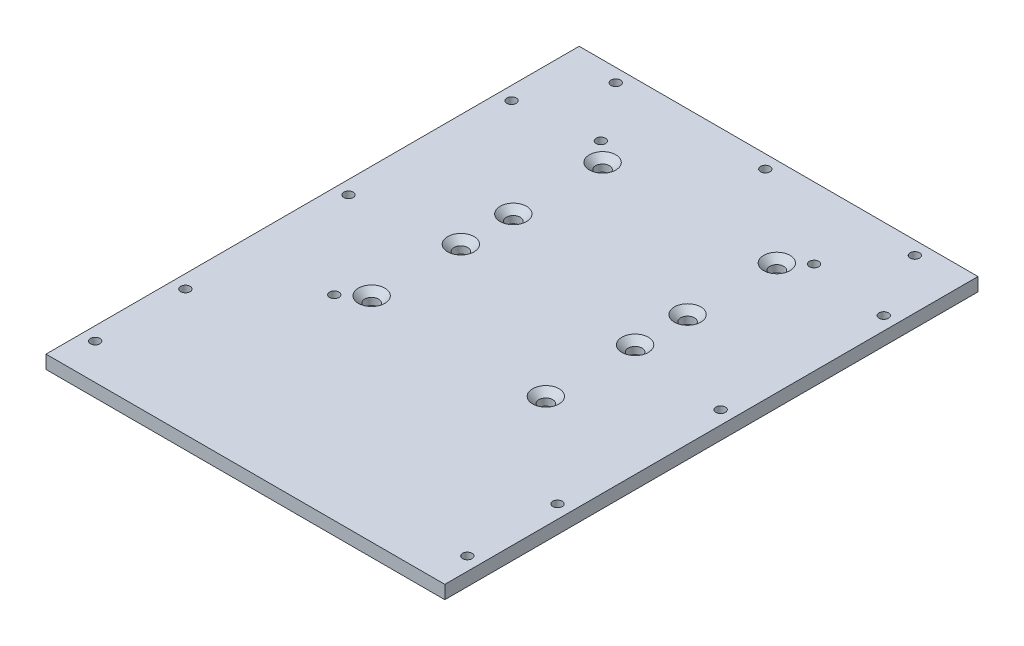
ISO-10303-21;
HEADER;
FILE_DESCRIPTION(('STEP AP214'),'2;1');
FILE_NAME('part.step','',(''),(''),'','','');
FILE_SCHEMA(('AUTOMOTIVE_DESIGN { 1 0 10303 214 1 1 1 1 }'));
ENDSEC;
DATA;
#1=APPLICATION_CONTEXT('core data for automotive mechanical design processes');
#2=APPLICATION_PROTOCOL_DEFINITION('international standard','automotive_design',2000,#1);
#3=PRODUCT_CONTEXT('',#1,'mechanical');
#4=PRODUCT('Part','Part','',(#3));
#5=PRODUCT_RELATED_PRODUCT_CATEGORY('part','',(#4));
#6=PRODUCT_DEFINITION_FORMATION('','',#4);
#7=PRODUCT_DEFINITION_CONTEXT('part definition',#1,'design');
#8=PRODUCT_DEFINITION('design','',#6,#7);
#9=PRODUCT_DEFINITION_SHAPE('','',#8);
#10=(LENGTH_UNIT() NAMED_UNIT(*) SI_UNIT(.MILLI.,.METRE.));
#11=(NAMED_UNIT(*) PLANE_ANGLE_UNIT() SI_UNIT($,.RADIAN.));
#12=(NAMED_UNIT(*) SI_UNIT($,.STERADIAN.) SOLID_ANGLE_UNIT());
#13=UNCERTAINTY_MEASURE_WITH_UNIT(LENGTH_MEASURE(1.E-05),#10,'distance_accuracy_value','');
#14=(GEOMETRIC_REPRESENTATION_CONTEXT(3) GLOBAL_UNCERTAINTY_ASSIGNED_CONTEXT((#13)) GLOBAL_UNIT_ASSIGNED_CONTEXT((#10,
#11,#12)) REPRESENTATION_CONTEXT('',''));
#15=CARTESIAN_POINT('',(0.,0.,0.));
#16=DIRECTION('',(0.,0.,1.));
#17=DIRECTION('',(1.,0.,0.));
#18=AXIS2_PLACEMENT_3D('',#15,#16,#17);
#19=CARTESIAN_POINT('',(0.,6.35,0.));
#20=DIRECTION('',(0.,1.,0.));
#21=DIRECTION('',(0.,0.,1.));
#22=AXIS2_PLACEMENT_3D('',#19,#20,#21);
#23=PLANE('',#22);
#24=CARTESIAN_POINT('',(41.5036,6.35,-17.145));
#25=DIRECTION('',(0.,1.,0.));
#26=DIRECTION('',(0.,0.,1.));
#27=AXIS2_PLACEMENT_3D('',#24,#25,#26);
#28=CIRCLE('',#27,6.2992);
#29=CARTESIAN_POINT('',(41.5036,6.35,-10.8458));
#30=VERTEX_POINT('',#29);
#31=EDGE_CURVE('E632',#30,#30,#28,.T.);
#32=ORIENTED_EDGE('',*,*,#31,.F.);
#33=EDGE_LOOP('',(#32));
#34=FACE_BOUND('',#33,.T.);
#35=CARTESIAN_POINT('',(41.5036,6.35,25.3746));
#36=DIRECTION('',(0.,1.,0.));
#37=DIRECTION('',(0.,0.,1.));
#38=AXIS2_PLACEMENT_3D('',#35,#36,#37);
#39=CIRCLE('',#38,6.2992);
#40=CARTESIAN_POINT('',(41.5036,6.35,31.6738));
#41=VERTEX_POINT('',#40);
#42=EDGE_CURVE('E148',#41,#41,#39,.T.);
#43=ORIENTED_EDGE('',*,*,#42,.F.);
#44=EDGE_LOOP('',(#43));
#45=FACE_BOUND('',#44,.T.);
#46=CARTESIAN_POINT('',(41.5036,6.35,-42.1386));
#47=DIRECTION('',(0.,1.,0.));
#48=DIRECTION('',(0.,0.,1.));
#49=AXIS2_PLACEMENT_3D('',#46,#47,#48);
#50=CIRCLE('',#49,6.2992);
#51=CARTESIAN_POINT('',(41.5036,6.35,-35.8394));
#52=VERTEX_POINT('',#51);
#53=EDGE_CURVE('E141',#52,#52,#50,.T.);
#54=ORIENTED_EDGE('',*,*,#53,.F.);
#55=EDGE_LOOP('',(#54));
#56=FACE_BOUND('',#55,.T.);
#57=CARTESIAN_POINT('',(41.5036,6.35,-84.6582));
#58=DIRECTION('',(0.,1.,0.));
#59=DIRECTION('',(0.,0.,1.));
#60=AXIS2_PLACEMENT_3D('',#57,#58,#59);
#61=CIRCLE('',#60,6.2992);
#62=CARTESIAN_POINT('',(41.5036,6.35,-78.359));
#63=VERTEX_POINT('',#62);
#64=EDGE_CURVE('E137',#63,#63,#61,.T.);
#65=ORIENTED_EDGE('',*,*,#64,.F.);
#66=EDGE_LOOP('',(#65));
#67=FACE_BOUND('',#66,.T.);
#68=CARTESIAN_POINT('',(-41.5036,6.35,-17.145));
#69=DIRECTION('',(0.,1.,0.));
#70=DIRECTION('',(0.,0.,1.));
#71=AXIS2_PLACEMENT_3D('',#68,#69,#70);
#72=CIRCLE('',#71,6.2992);
#73=CARTESIAN_POINT('',(-41.5036,6.35,-10.8458));
#74=VERTEX_POINT('',#73);
#75=EDGE_CURVE('E133',#74,#74,#72,.T.);
#76=ORIENTED_EDGE('',*,*,#75,.F.);
#77=EDGE_LOOP('',(#76));
#78=FACE_BOUND('',#77,.T.);
#79=CARTESIAN_POINT('',(-41.5036,6.35,25.3746));
#80=DIRECTION('',(0.,1.,0.));
#81=DIRECTION('',(0.,0.,1.));
#82=AXIS2_PLACEMENT_3D('',#79,#80,#81);
#83=CIRCLE('',#82,6.2992);
#84=CARTESIAN_POINT('',(-41.5036,6.35,31.6738));
#85=VERTEX_POINT('',#84);
#86=EDGE_CURVE('E128',#85,#85,#83,.T.);
#87=ORIENTED_EDGE('',*,*,#86,.F.);
#88=EDGE_LOOP('',(#87));
#89=FACE_BOUND('',#88,.T.);
#90=CARTESIAN_POINT('',(-41.5036,6.35,-42.1386));
#91=DIRECTION('',(0.,1.,0.));
#92=DIRECTION('',(0.,0.,1.));
#93=AXIS2_PLACEMENT_3D('',#90,#91,#92);
#94=CIRCLE('',#93,6.2992);
#95=CARTESIAN_POINT('',(-41.5036,6.35,-35.8394));
#96=VERTEX_POINT('',#95);
#97=EDGE_CURVE('E123',#96,#96,#94,.T.);
#98=ORIENTED_EDGE('',*,*,#97,.F.);
#99=EDGE_LOOP('',(#98));
#100=FACE_BOUND('',#99,.T.);
#101=CARTESIAN_POINT('',(-41.5036,6.35,-84.6582));
#102=DIRECTION('',(0.,1.,0.));
#103=DIRECTION('',(0.,0.,1.));
#104=AXIS2_PLACEMENT_3D('',#101,#102,#103);
#105=CIRCLE('',#104,6.2992);
#106=CARTESIAN_POINT('',(-41.5036,6.35,-78.359));
#107=VERTEX_POINT('',#106);
#108=EDGE_CURVE('E118',#107,#107,#105,.T.);
#109=ORIENTED_EDGE('',*,*,#108,.F.);
#110=EDGE_LOOP('',(#109));
#111=FACE_BOUND('',#110,.T.);
#112=CARTESIAN_POINT('',(-50.8,6.35,33.8836));
#113=DIRECTION('',(0.,1.,0.));
#114=DIRECTION('',(0.,0.,1.));
#115=AXIS2_PLACEMENT_3D('',#112,#113,#114);
#116=CIRCLE('',#115,2.2479);
#117=CARTESIAN_POINT('',(-50.8,6.35,36.1315));
#118=VERTEX_POINT('',#117);
#119=EDGE_CURVE('E113',#118,#118,#116,.T.);
#120=ORIENTED_EDGE('',*,*,#119,.F.);
#121=EDGE_LOOP('',(#120));
#122=FACE_BOUND('',#121,.T.);
#123=CARTESIAN_POINT('',(88.646,6.35,66.9544));
#124=DIRECTION('',(0.,-1.,0.));
#125=DIRECTION('',(0.,0.,1.));
#126=AXIS2_PLACEMENT_3D('',#123,#124,#125);
#127=CIRCLE('',#126,2.2479);
#128=CARTESIAN_POINT('',(88.646,6.35,69.2023));
#129=VERTEX_POINT('',#128);
#130=EDGE_CURVE('E194',#129,#129,#127,.T.);
#131=ORIENTED_EDGE('',*,*,#130,.T.);
#132=EDGE_LOOP('',(#131));
#133=FACE_BOUND('',#132,.T.);
#134=CARTESIAN_POINT('',(88.646,6.35,-88.4428));
#135=DIRECTION('',(0.,-1.,0.));
#136=DIRECTION('',(0.,0.,1.));
#137=AXIS2_PLACEMENT_3D('',#134,#135,#136);
#138=CIRCLE('',#137,2.2479);
#139=CARTESIAN_POINT('',(88.646,6.35,-86.1949));
#140=VERTEX_POINT('',#139);
#141=EDGE_CURVE('E206',#140,#140,#138,.T.);
#142=ORIENTED_EDGE('',*,*,#141,.T.);
#143=EDGE_LOOP('',(#142));
#144=FACE_BOUND('',#143,.T.);
#145=CARTESIAN_POINT('',(71.247,6.35,-120.65));
#146=DIRECTION('',(0.,-1.,0.));
#147=DIRECTION('',(0.,0.,1.));
#148=AXIS2_PLACEMENT_3D('',#145,#146,#147);
#149=CIRCLE('',#148,2.2479);
#150=CARTESIAN_POINT('',(71.247,6.35,-118.4021));
#151=VERTEX_POINT('',#150);
#152=EDGE_CURVE('E181',#151,#151,#149,.T.);
#153=ORIENTED_EDGE('',*,*,#152,.T.);
#154=EDGE_LOOP('',(#153));
#155=FACE_BOUND('',#154,.T.);
#156=CARTESIAN_POINT('',(-88.646,6.35,109.9312));
#157=DIRECTION('',(0.,1.,0.));
#158=DIRECTION('',(0.,0.,1.));
#159=AXIS2_PLACEMENT_3D('',#156,#157,#158);
#160=CIRCLE('',#159,2.2479);
#161=CARTESIAN_POINT('',(-88.646,6.35,112.1791));
#162=VERTEX_POINT('',#161);
#163=EDGE_CURVE('E222',#162,#162,#160,.T.);
#164=ORIENTED_EDGE('',*,*,#163,.F.);
#165=EDGE_LOOP('',(#164));
#166=FACE_BOUND('',#165,.T.);
#167=CARTESIAN_POINT('',(-88.646,6.35,66.9544));
#168=DIRECTION('',(0.,1.,0.));
#169=DIRECTION('',(0.,0.,1.));
#170=AXIS2_PLACEMENT_3D('',#167,#168,#169);
#171=CIRCLE('',#170,2.2479);
#172=CARTESIAN_POINT('',(-88.646,6.35,69.2023));
#173=VERTEX_POINT('',#172);
#174=EDGE_CURVE('E228',#173,#173,#171,.T.);
#175=ORIENTED_EDGE('',*,*,#174,.F.);
#176=EDGE_LOOP('',(#175));
#177=FACE_BOUND('',#176,.T.);
#178=CARTESIAN_POINT('',(-88.646,6.35,-10.7442));
#179=DIRECTION('',(0.,1.,0.));
#180=DIRECTION('',(0.,0.,1.));
#181=AXIS2_PLACEMENT_3D('',#178,#179,#180);
#182=CIRCLE('',#181,2.2479);
#183=CARTESIAN_POINT('',(-88.646,6.35,-8.49629999999999));
#184=VERTEX_POINT('',#183);
#185=EDGE_CURVE('E234',#184,#184,#182,.T.);
#186=ORIENTED_EDGE('',*,*,#185,.F.);
#187=EDGE_LOOP('',(#186));
#188=FACE_BOUND('',#187,.T.);
#189=CARTESIAN_POINT('',(-88.646,6.35,-88.4428));
#190=DIRECTION('',(0.,1.,0.));
#191=DIRECTION('',(0.,0.,1.));
#192=AXIS2_PLACEMENT_3D('',#189,#190,#191);
#193=CIRCLE('',#192,2.2479);
#194=CARTESIAN_POINT('',(-88.646,6.35,-86.1949));
#195=VERTEX_POINT('',#194);
#196=EDGE_CURVE('E240',#195,#195,#193,.T.);
#197=ORIENTED_EDGE('',*,*,#196,.F.);
#198=EDGE_LOOP('',(#197));
#199=FACE_BOUND('',#198,.T.);
#200=CARTESIAN_POINT('',(-50.8,6.35,-93.1164));
#201=DIRECTION('',(0.,1.,0.));
#202=DIRECTION('',(0.,0.,1.));
#203=AXIS2_PLACEMENT_3D('',#200,#201,#202);
#204=CIRCLE('',#203,2.2479);
#205=CARTESIAN_POINT('',(-50.8,6.35,-90.8685));
#206=VERTEX_POINT('',#205);
#207=EDGE_CURVE('E246',#206,#206,#204,.T.);
#208=ORIENTED_EDGE('',*,*,#207,.F.);
#209=EDGE_LOOP('',(#208));
#210=FACE_BOUND('',#209,.T.);
#211=CARTESIAN_POINT('',(-71.247,6.35,-120.65));
#212=DIRECTION('',(0.,1.,0.));
#213=DIRECTION('',(0.,0.,1.));
#214=AXIS2_PLACEMENT_3D('',#211,#212,#213);
#215=CIRCLE('',#214,2.2479);
#216=CARTESIAN_POINT('',(-71.247,6.35,-118.4021));
#217=VERTEX_POINT('',#216);
#218=EDGE_CURVE('E252',#217,#217,#215,.T.);
#219=ORIENTED_EDGE('',*,*,#218,.F.);
#220=EDGE_LOOP('',(#219));
#221=FACE_BOUND('',#220,.T.);
#222=CARTESIAN_POINT('',(0.,6.35,-120.65));
#223=DIRECTION('',(0.,1.,0.));
#224=DIRECTION('',(0.,0.,1.));
#225=AXIS2_PLACEMENT_3D('',#222,#223,#224);
#226=CIRCLE('',#225,2.2479);
#227=CARTESIAN_POINT('',(0.,6.35,-118.4021));
#228=VERTEX_POINT('',#227);
#229=EDGE_CURVE('E187',#228,#228,#226,.T.);
#230=ORIENTED_EDGE('',*,*,#229,.F.);
#231=EDGE_LOOP('',(#230));
#232=FACE_BOUND('',#231,.T.);
#233=DIRECTION('',(0.,0.,1.));
#234=VECTOR('',#233,1.);
#235=CARTESIAN_POINT('',(-94.996,6.35,-127.));
#236=LINE('',#235,#234);
#237=CARTESIAN_POINT('',(-94.996,6.35,-127.));
#238=VERTEX_POINT('',#237);
#239=CARTESIAN_POINT('',(-94.996,6.35,127.));
#240=VERTEX_POINT('',#239);
#241=EDGE_CURVE('E88',#238,#240,#236,.T.);
#242=ORIENTED_EDGE('',*,*,#241,.T.);
#243=DIRECTION('',(1.,0.,0.));
#244=VECTOR('',#243,1.);
#245=CARTESIAN_POINT('',(-94.996,6.35,127.));
#246=LINE('',#245,#244);
#247=CARTESIAN_POINT('',(94.996,6.35,127.));
#248=VERTEX_POINT('',#247);
#249=EDGE_CURVE('E83',#240,#248,#246,.T.);
#250=ORIENTED_EDGE('',*,*,#249,.T.);
#251=DIRECTION('',(0.,0.,-1.));
#252=VECTOR('',#251,1.);
#253=CARTESIAN_POINT('',(94.996,6.35,-127.));
#254=LINE('',#253,#252);
#255=CARTESIAN_POINT('',(94.996,6.35,-127.));
#256=VERTEX_POINT('',#255);
#257=EDGE_CURVE('E86',#248,#256,#254,.T.);
#258=ORIENTED_EDGE('',*,*,#257,.T.);
#259=DIRECTION('',(-1.,0.,0.));
#260=VECTOR('',#259,1.);
#261=CARTESIAN_POINT('',(-94.996,6.35,-127.));
#262=LINE('',#261,#260);
#263=EDGE_CURVE('E53',#256,#238,#262,.T.);
#264=ORIENTED_EDGE('',*,*,#263,.T.);
#265=EDGE_LOOP('',(#242,#250,#258,#264));
#266=FACE_BOUND('',#265,.T.);
#267=CARTESIAN_POINT('',(50.8,6.35,-93.1164));
#268=DIRECTION('',(0.,-1.,0.));
#269=DIRECTION('',(0.,0.,1.));
#270=AXIS2_PLACEMENT_3D('',#267,#268,#269);
#271=CIRCLE('',#270,2.2479);
#272=CARTESIAN_POINT('',(50.8,6.35,-90.8685));
#273=VERTEX_POINT('',#272);
#274=EDGE_CURVE('E212',#273,#273,#271,.T.);
#275=ORIENTED_EDGE('',*,*,#274,.T.);
#276=EDGE_LOOP('',(#275));
#277=FACE_BOUND('',#276,.T.);
#278=CARTESIAN_POINT('',(88.646,6.35,-10.7442));
#279=DIRECTION('',(0.,-1.,0.));
#280=DIRECTION('',(0.,0.,1.));
#281=AXIS2_PLACEMENT_3D('',#278,#279,#280);
#282=CIRCLE('',#281,2.2479);
#283=CARTESIAN_POINT('',(88.646,6.35,-8.49629999999999));
#284=VERTEX_POINT('',#283);
#285=EDGE_CURVE('E200',#284,#284,#282,.T.);
#286=ORIENTED_EDGE('',*,*,#285,.T.);
#287=EDGE_LOOP('',(#286));
#288=FACE_BOUND('',#287,.T.);
#289=CARTESIAN_POINT('',(88.646,6.35,109.9312));
#290=DIRECTION('',(0.,-1.,0.));
#291=DIRECTION('',(0.,0.,1.));
#292=AXIS2_PLACEMENT_3D('',#289,#290,#291);
#293=CIRCLE('',#292,2.2479);
#294=CARTESIAN_POINT('',(88.646,6.35,112.1791));
#295=VERTEX_POINT('',#294);
#296=EDGE_CURVE('E188',#295,#295,#293,.T.);
#297=ORIENTED_EDGE('',*,*,#296,.T.);
#298=EDGE_LOOP('',(#297));
#299=FACE_BOUND('',#298,.T.);
#300=ADVANCED_FACE('F34',(#34,#45,#56,#67,#78,#89,#100,#111,#122,#133,#144,#155,#166,#177,#188,
#199,#210,#221,#232,#266,#277,#288,#299),#23,.T.);
#301=CARTESIAN_POINT('',(0.,0.,0.));
#302=DIRECTION('',(0.,1.,0.));
#303=DIRECTION('',(0.,0.,1.));
#304=AXIS2_PLACEMENT_3D('',#301,#302,#303);
#305=PLANE('',#304);
#306=CARTESIAN_POINT('',(41.5036,0.,-17.145));
#307=DIRECTION('',(0.,1.,0.));
#308=DIRECTION('',(0.,0.,1.));
#309=AXIS2_PLACEMENT_3D('',#306,#307,#308);
#310=CIRCLE('',#309,3.302);
#311=CARTESIAN_POINT('',(41.5036,0.,-13.843));
#312=VERTEX_POINT('',#311);
#313=EDGE_CURVE('E38',#312,#312,#310,.T.);
#314=ORIENTED_EDGE('',*,*,#313,.T.);
#315=EDGE_LOOP('',(#314));
#316=FACE_BOUND('',#315,.T.);
#317=CARTESIAN_POINT('',(41.5036,0.,25.3746));
#318=DIRECTION('',(0.,1.,0.));
#319=DIRECTION('',(0.,0.,1.));
#320=AXIS2_PLACEMENT_3D('',#317,#318,#319);
#321=CIRCLE('',#320,3.302);
#322=CARTESIAN_POINT('',(41.5036,0.,28.6766));
#323=VERTEX_POINT('',#322);
#324=EDGE_CURVE('E139',#323,#323,#321,.T.);
#325=ORIENTED_EDGE('',*,*,#324,.T.);
#326=EDGE_LOOP('',(#325));
#327=FACE_BOUND('',#326,.T.);
#328=CARTESIAN_POINT('',(41.5036,0.,-42.1386));
#329=DIRECTION('',(0.,1.,0.));
#330=DIRECTION('',(0.,0.,1.));
#331=AXIS2_PLACEMENT_3D('',#328,#329,#330);
#332=CIRCLE('',#331,3.302);
#333=CARTESIAN_POINT('',(41.5036,0.,-38.8366));
#334=VERTEX_POINT('',#333);
#335=EDGE_CURVE('E135',#334,#334,#332,.T.);
#336=ORIENTED_EDGE('',*,*,#335,.T.);
#337=EDGE_LOOP('',(#336));
#338=FACE_BOUND('',#337,.T.);
#339=CARTESIAN_POINT('',(41.5036,0.,-84.6582));
#340=DIRECTION('',(0.,1.,0.));
#341=DIRECTION('',(0.,0.,1.));
#342=AXIS2_PLACEMENT_3D('',#339,#340,#341);
#343=CIRCLE('',#342,3.302);
#344=CARTESIAN_POINT('',(41.5036,0.,-81.3562));
#345=VERTEX_POINT('',#344);
#346=EDGE_CURVE('E130',#345,#345,#343,.T.);
#347=ORIENTED_EDGE('',*,*,#346,.T.);
#348=EDGE_LOOP('',(#347));
#349=FACE_BOUND('',#348,.T.);
#350=CARTESIAN_POINT('',(-41.5036,0.,-17.145));
#351=DIRECTION('',(0.,1.,0.));
#352=DIRECTION('',(0.,0.,1.));
#353=AXIS2_PLACEMENT_3D('',#350,#351,#352);
#354=CIRCLE('',#353,3.302);
#355=CARTESIAN_POINT('',(-41.5036,0.,-13.843));
#356=VERTEX_POINT('',#355);
#357=EDGE_CURVE('E125',#356,#356,#354,.T.);
#358=ORIENTED_EDGE('',*,*,#357,.T.);
#359=EDGE_LOOP('',(#358));
#360=FACE_BOUND('',#359,.T.);
#361=CARTESIAN_POINT('',(-41.5036,0.,25.3746));
#362=DIRECTION('',(0.,1.,0.));
#363=DIRECTION('',(0.,0.,1.));
#364=AXIS2_PLACEMENT_3D('',#361,#362,#363);
#365=CIRCLE('',#364,3.302);
#366=CARTESIAN_POINT('',(-41.5036,0.,28.6766));
#367=VERTEX_POINT('',#366);
#368=EDGE_CURVE('E120',#367,#367,#365,.T.);
#369=ORIENTED_EDGE('',*,*,#368,.T.);
#370=EDGE_LOOP('',(#369));
#371=FACE_BOUND('',#370,.T.);
#372=CARTESIAN_POINT('',(-41.5036,0.,-42.1386));
#373=DIRECTION('',(0.,1.,0.));
#374=DIRECTION('',(0.,0.,1.));
#375=AXIS2_PLACEMENT_3D('',#372,#373,#374);
#376=CIRCLE('',#375,3.302);
#377=CARTESIAN_POINT('',(-41.5036,0.,-38.8366));
#378=VERTEX_POINT('',#377);
#379=EDGE_CURVE('E115',#378,#378,#376,.T.);
#380=ORIENTED_EDGE('',*,*,#379,.T.);
#381=EDGE_LOOP('',(#380));
#382=FACE_BOUND('',#381,.T.);
#383=CARTESIAN_POINT('',(-41.5036,0.,-84.6582));
#384=DIRECTION('',(0.,1.,0.));
#385=DIRECTION('',(0.,0.,1.));
#386=AXIS2_PLACEMENT_3D('',#383,#384,#385);
#387=CIRCLE('',#386,3.302);
#388=CARTESIAN_POINT('',(-41.5036,0.,-81.3562));
#389=VERTEX_POINT('',#388);
#390=EDGE_CURVE('E110',#389,#389,#387,.T.);
#391=ORIENTED_EDGE('',*,*,#390,.T.);
#392=EDGE_LOOP('',(#391));
#393=FACE_BOUND('',#392,.T.);
#394=CARTESIAN_POINT('',(-50.8,0.,33.8836));
#395=DIRECTION('',(0.,1.,0.));
#396=DIRECTION('',(0.,0.,1.));
#397=AXIS2_PLACEMENT_3D('',#394,#395,#396);
#398=CIRCLE('',#397,2.2479);
#399=CARTESIAN_POINT('',(-50.8,0.,36.1315));
#400=VERTEX_POINT('',#399);
#401=EDGE_CURVE('E178',#400,#400,#398,.T.);
#402=ORIENTED_EDGE('',*,*,#401,.T.);
#403=EDGE_LOOP('',(#402));
#404=FACE_BOUND('',#403,.T.);
#405=CARTESIAN_POINT('',(-88.646,0.,109.9312));
#406=DIRECTION('',(0.,1.,0.));
#407=DIRECTION('',(0.,0.,1.));
#408=AXIS2_PLACEMENT_3D('',#405,#406,#407);
#409=CIRCLE('',#408,2.2479);
#410=CARTESIAN_POINT('',(-88.646,0.,112.1791));
#411=VERTEX_POINT('',#410);
#412=EDGE_CURVE('E104',#411,#411,#409,.T.);
#413=ORIENTED_EDGE('',*,*,#412,.T.);
#414=EDGE_LOOP('',(#413));
#415=FACE_BOUND('',#414,.T.);
#416=CARTESIAN_POINT('',(-88.646,0.,66.9544));
#417=DIRECTION('',(0.,1.,0.));
#418=DIRECTION('',(0.,0.,1.));
#419=AXIS2_PLACEMENT_3D('',#416,#417,#418);
#420=CIRCLE('',#419,2.2479);
#421=CARTESIAN_POINT('',(-88.646,0.,69.2023));
#422=VERTEX_POINT('',#421);
#423=EDGE_CURVE('E225',#422,#422,#420,.T.);
#424=ORIENTED_EDGE('',*,*,#423,.T.);
#425=EDGE_LOOP('',(#424));
#426=FACE_BOUND('',#425,.T.);
#427=CARTESIAN_POINT('',(-88.646,0.,-10.7442));
#428=DIRECTION('',(0.,1.,0.));
#429=DIRECTION('',(0.,0.,1.));
#430=AXIS2_PLACEMENT_3D('',#427,#428,#429);
#431=CIRCLE('',#430,2.2479);
#432=CARTESIAN_POINT('',(-88.646,0.,-8.49629999999999));
#433=VERTEX_POINT('',#432);
#434=EDGE_CURVE('E231',#433,#433,#431,.T.);
#435=ORIENTED_EDGE('',*,*,#434,.T.);
#436=EDGE_LOOP('',(#435));
#437=FACE_BOUND('',#436,.T.);
#438=CARTESIAN_POINT('',(-88.646,0.,-88.4428));
#439=DIRECTION('',(0.,1.,0.));
#440=DIRECTION('',(0.,0.,1.));
#441=AXIS2_PLACEMENT_3D('',#438,#439,#440);
#442=CIRCLE('',#441,2.2479);
#443=CARTESIAN_POINT('',(-88.646,0.,-86.1949));
#444=VERTEX_POINT('',#443);
#445=EDGE_CURVE('E237',#444,#444,#442,.T.);
#446=ORIENTED_EDGE('',*,*,#445,.T.);
#447=EDGE_LOOP('',(#446));
#448=FACE_BOUND('',#447,.T.);
#449=CARTESIAN_POINT('',(-50.8,0.,-93.1164));
#450=DIRECTION('',(0.,1.,0.));
#451=DIRECTION('',(0.,0.,1.));
#452=AXIS2_PLACEMENT_3D('',#449,#450,#451);
#453=CIRCLE('',#452,2.2479);
#454=CARTESIAN_POINT('',(-50.8,0.,-90.8685));
#455=VERTEX_POINT('',#454);
#456=EDGE_CURVE('E243',#455,#455,#453,.T.);
#457=ORIENTED_EDGE('',*,*,#456,.T.);
#458=EDGE_LOOP('',(#457));
#459=FACE_BOUND('',#458,.T.);
#460=CARTESIAN_POINT('',(-71.247,0.,-120.65));
#461=DIRECTION('',(0.,1.,0.));
#462=DIRECTION('',(0.,0.,1.));
#463=AXIS2_PLACEMENT_3D('',#460,#461,#462);
#464=CIRCLE('',#463,2.2479);
#465=CARTESIAN_POINT('',(-71.247,0.,-118.4021));
#466=VERTEX_POINT('',#465);
#467=EDGE_CURVE('E249',#466,#466,#464,.T.);
#468=ORIENTED_EDGE('',*,*,#467,.T.);
#469=EDGE_LOOP('',(#468));
#470=FACE_BOUND('',#469,.T.);
#471=CARTESIAN_POINT('',(0.,0.,-120.65));
#472=DIRECTION('',(0.,1.,0.));
#473=DIRECTION('',(0.,0.,1.));
#474=AXIS2_PLACEMENT_3D('',#471,#472,#473);
#475=CIRCLE('',#474,2.2479);
#476=CARTESIAN_POINT('',(0.,0.,-118.4021));
#477=VERTEX_POINT('',#476);
#478=EDGE_CURVE('E255',#477,#477,#475,.T.);
#479=ORIENTED_EDGE('',*,*,#478,.T.);
#480=EDGE_LOOP('',(#479));
#481=FACE_BOUND('',#480,.T.);
#482=DIRECTION('',(0.,0.,1.));
#483=VECTOR('',#482,1.);
#484=CARTESIAN_POINT('',(-94.996,0.,-127.));
#485=LINE('',#484,#483);
#486=CARTESIAN_POINT('',(-94.996,0.,-127.));
#487=VERTEX_POINT('',#486);
#488=CARTESIAN_POINT('',(-94.996,0.,127.));
#489=VERTEX_POINT('',#488);
#490=EDGE_CURVE('E101',#487,#489,#485,.T.);
#491=ORIENTED_EDGE('',*,*,#490,.F.);
#492=DIRECTION('',(-1.,0.,0.));
#493=VECTOR('',#492,1.);
#494=CARTESIAN_POINT('',(-94.996,0.,-127.));
#495=LINE('',#494,#493);
#496=CARTESIAN_POINT('',(94.996,0.,-127.));
#497=VERTEX_POINT('',#496);
#498=EDGE_CURVE('E76',#497,#487,#495,.T.);
#499=ORIENTED_EDGE('',*,*,#498,.F.);
#500=DIRECTION('',(0.,0.,-1.));
#501=VECTOR('',#500,1.);
#502=CARTESIAN_POINT('',(94.996,0.,-127.));
#503=LINE('',#502,#501);
#504=CARTESIAN_POINT('',(94.996,0.,127.));
#505=VERTEX_POINT('',#504);
#506=EDGE_CURVE('E70',#505,#497,#503,.T.);
#507=ORIENTED_EDGE('',*,*,#506,.F.);
#508=DIRECTION('',(1.,0.,0.));
#509=VECTOR('',#508,1.);
#510=CARTESIAN_POINT('',(-94.996,0.,127.));
#511=LINE('',#510,#509);
#512=EDGE_CURVE('E92',#489,#505,#511,.T.);
#513=ORIENTED_EDGE('',*,*,#512,.F.);
#514=EDGE_LOOP('',(#491,#499,#507,#513));
#515=FACE_BOUND('',#514,.T.);
#516=CARTESIAN_POINT('',(71.247,0.,-120.65));
#517=DIRECTION('',(0.,-1.,0.));
#518=DIRECTION('',(0.,0.,1.));
#519=AXIS2_PLACEMENT_3D('',#516,#517,#518);
#520=CIRCLE('',#519,2.2479);
#521=CARTESIAN_POINT('',(71.247,0.,-118.4021));
#522=VERTEX_POINT('',#521);
#523=EDGE_CURVE('E215',#522,#522,#520,.T.);
#524=ORIENTED_EDGE('',*,*,#523,.F.);
#525=EDGE_LOOP('',(#524));
#526=FACE_BOUND('',#525,.T.);
#527=CARTESIAN_POINT('',(50.8,0.,-93.1164));
#528=DIRECTION('',(0.,-1.,0.));
#529=DIRECTION('',(0.,0.,1.));
#530=AXIS2_PLACEMENT_3D('',#527,#528,#529);
#531=CIRCLE('',#530,2.2479);
#532=CARTESIAN_POINT('',(50.8,0.,-90.8685));
#533=VERTEX_POINT('',#532);
#534=EDGE_CURVE('E209',#533,#533,#531,.T.);
#535=ORIENTED_EDGE('',*,*,#534,.F.);
#536=EDGE_LOOP('',(#535));
#537=FACE_BOUND('',#536,.T.);
#538=CARTESIAN_POINT('',(88.646,0.,-88.4428));
#539=DIRECTION('',(0.,-1.,0.));
#540=DIRECTION('',(0.,0.,1.));
#541=AXIS2_PLACEMENT_3D('',#538,#539,#540);
#542=CIRCLE('',#541,2.2479);
#543=CARTESIAN_POINT('',(88.646,0.,-86.1949));
#544=VERTEX_POINT('',#543);
#545=EDGE_CURVE('E203',#544,#544,#542,.T.);
#546=ORIENTED_EDGE('',*,*,#545,.F.);
#547=EDGE_LOOP('',(#546));
#548=FACE_BOUND('',#547,.T.);
#549=CARTESIAN_POINT('',(88.646,0.,-10.7442));
#550=DIRECTION('',(0.,-1.,0.));
#551=DIRECTION('',(0.,0.,1.));
#552=AXIS2_PLACEMENT_3D('',#549,#550,#551);
#553=CIRCLE('',#552,2.2479);
#554=CARTESIAN_POINT('',(88.646,0.,-8.49629999999999));
#555=VERTEX_POINT('',#554);
#556=EDGE_CURVE('E197',#555,#555,#553,.T.);
#557=ORIENTED_EDGE('',*,*,#556,.F.);
#558=EDGE_LOOP('',(#557));
#559=FACE_BOUND('',#558,.T.);
#560=CARTESIAN_POINT('',(88.646,0.,66.9544));
#561=DIRECTION('',(0.,-1.,0.));
#562=DIRECTION('',(0.,0.,1.));
#563=AXIS2_PLACEMENT_3D('',#560,#561,#562);
#564=CIRCLE('',#563,2.2479);
#565=CARTESIAN_POINT('',(88.646,0.,69.2023));
#566=VERTEX_POINT('',#565);
#567=EDGE_CURVE('E191',#566,#566,#564,.T.);
#568=ORIENTED_EDGE('',*,*,#567,.F.);
#569=EDGE_LOOP('',(#568));
#570=FACE_BOUND('',#569,.T.);
#571=CARTESIAN_POINT('',(88.646,0.,109.9312));
#572=DIRECTION('',(0.,-1.,0.));
#573=DIRECTION('',(0.,0.,1.));
#574=AXIS2_PLACEMENT_3D('',#571,#572,#573);
#575=CIRCLE('',#574,2.2479);
#576=CARTESIAN_POINT('',(88.646,0.,112.1791));
#577=VERTEX_POINT('',#576);
#578=EDGE_CURVE('E184',#577,#577,#575,.T.);
#579=ORIENTED_EDGE('',*,*,#578,.F.);
#580=EDGE_LOOP('',(#579));
#581=FACE_BOUND('',#580,.T.);
#582=ADVANCED_FACE('F264',(#316,#327,#338,#349,#360,#371,#382,#393,#404,#415,#426,#437,#448,
#459,#470,#481,#515,#526,#537,#548,#559,#570,#581),#305,.F.);
#583=CARTESIAN_POINT('',(-94.996,6.35,-127.));
#584=DIRECTION('',(1.,0.,0.));
#585=DIRECTION('',(0.,0.,-1.));
#586=AXIS2_PLACEMENT_3D('',#583,#584,#585);
#587=PLANE('',#586);
#588=ORIENTED_EDGE('',*,*,#490,.T.);
#589=DIRECTION('',(0.,-1.,0.));
#590=VECTOR('',#589,1.);
#591=CARTESIAN_POINT('',(-94.996,6.35,127.));
#592=LINE('',#591,#590);
#593=EDGE_CURVE('E11',#240,#489,#592,.T.);
#594=ORIENTED_EDGE('',*,*,#593,.F.);
#595=ORIENTED_EDGE('',*,*,#241,.F.);
#596=DIRECTION('',(0.,-1.,0.));
#597=VECTOR('',#596,1.);
#598=CARTESIAN_POINT('',(-94.996,6.35,-127.));
#599=LINE('',#598,#597);
#600=EDGE_CURVE('E97',#238,#487,#599,.T.);
#601=ORIENTED_EDGE('',*,*,#600,.T.);
#602=EDGE_LOOP('',(#588,#594,#595,#601));
#603=FACE_BOUND('',#602,.T.);
#604=ADVANCED_FACE('F36',(#603),#587,.F.);
#605=CARTESIAN_POINT('',(-94.996,6.35,127.));
#606=DIRECTION('',(0.,0.,-1.));
#607=DIRECTION('',(-1.,0.,0.));
#608=AXIS2_PLACEMENT_3D('',#605,#606,#607);
#609=PLANE('',#608);
#610=ORIENTED_EDGE('',*,*,#512,.T.);
#611=DIRECTION('',(0.,-1.,0.));
#612=VECTOR('',#611,1.);
#613=CARTESIAN_POINT('',(94.996,6.35,127.));
#614=LINE('',#613,#612);
#615=EDGE_CURVE('E44',#248,#505,#614,.T.);
#616=ORIENTED_EDGE('',*,*,#615,.F.);
#617=ORIENTED_EDGE('',*,*,#249,.F.);
#618=ORIENTED_EDGE('',*,*,#593,.T.);
#619=EDGE_LOOP('',(#610,#616,#617,#618));
#620=FACE_BOUND('',#619,.T.);
#621=ADVANCED_FACE('F91',(#620),#609,.F.);
#622=CARTESIAN_POINT('',(94.996,6.35,-127.));
#623=DIRECTION('',(-1.,0.,0.));
#624=DIRECTION('',(0.,0.,1.));
#625=AXIS2_PLACEMENT_3D('',#622,#623,#624);
#626=PLANE('',#625);
#627=ORIENTED_EDGE('',*,*,#506,.T.);
#628=DIRECTION('',(0.,-1.,0.));
#629=VECTOR('',#628,1.);
#630=CARTESIAN_POINT('',(94.996,6.35,-127.));
#631=LINE('',#630,#629);
#632=EDGE_CURVE('E93',#256,#497,#631,.T.);
#633=ORIENTED_EDGE('',*,*,#632,.F.);
#634=ORIENTED_EDGE('',*,*,#257,.F.);
#635=ORIENTED_EDGE('',*,*,#615,.T.);
#636=EDGE_LOOP('',(#627,#633,#634,#635));
#637=FACE_BOUND('',#636,.T.);
#638=ADVANCED_FACE('F95',(#637),#626,.F.);
#639=CARTESIAN_POINT('',(-94.996,6.35,-127.));
#640=DIRECTION('',(0.,0.,1.));
#641=DIRECTION('',(1.,0.,0.));
#642=AXIS2_PLACEMENT_3D('',#639,#640,#641);
#643=PLANE('',#642);
#644=ORIENTED_EDGE('',*,*,#498,.T.);
#645=ORIENTED_EDGE('',*,*,#600,.F.);
#646=ORIENTED_EDGE('',*,*,#263,.F.);
#647=ORIENTED_EDGE('',*,*,#632,.T.);
#648=EDGE_LOOP('',(#644,#645,#646,#647));
#649=FACE_BOUND('',#648,.T.);
#650=ADVANCED_FACE('F277',(#649),#643,.F.);
#651=CARTESIAN_POINT('',(0.,0.,-120.65));
#652=DIRECTION('',(0.,1.,0.));
#653=DIRECTION('',(0.,0.,1.));
#654=AXIS2_PLACEMENT_3D('',#651,#652,#653);
#655=CYLINDRICAL_SURFACE('',#654,2.2479);
#656=ORIENTED_EDGE('',*,*,#478,.F.);
#657=EDGE_LOOP('',(#656));
#658=FACE_BOUND('',#657,.T.);
#659=ORIENTED_EDGE('',*,*,#229,.T.);
#660=EDGE_LOOP('',(#659));
#661=FACE_BOUND('',#660,.T.);
#662=ADVANCED_FACE('F261',(#658,#661),#655,.F.);
#663=CARTESIAN_POINT('',(-71.247,0.,-120.65));
#664=DIRECTION('',(0.,1.,0.));
#665=DIRECTION('',(0.,0.,1.));
#666=AXIS2_PLACEMENT_3D('',#663,#664,#665);
#667=CYLINDRICAL_SURFACE('',#666,2.2479);
#668=ORIENTED_EDGE('',*,*,#467,.F.);
#669=EDGE_LOOP('',(#668));
#670=FACE_BOUND('',#669,.T.);
#671=ORIENTED_EDGE('',*,*,#218,.T.);
#672=EDGE_LOOP('',(#671));
#673=FACE_BOUND('',#672,.T.);
#674=ADVANCED_FACE('F356',(#670,#673),#667,.F.);
#675=CARTESIAN_POINT('',(-50.8,0.,-93.1164));
#676=DIRECTION('',(0.,1.,0.));
#677=DIRECTION('',(0.,0.,1.));
#678=AXIS2_PLACEMENT_3D('',#675,#676,#677);
#679=CYLINDRICAL_SURFACE('',#678,2.2479);
#680=ORIENTED_EDGE('',*,*,#456,.F.);
#681=EDGE_LOOP('',(#680));
#682=FACE_BOUND('',#681,.T.);
#683=ORIENTED_EDGE('',*,*,#207,.T.);
#684=EDGE_LOOP('',(#683));
#685=FACE_BOUND('',#684,.T.);
#686=ADVANCED_FACE('F353',(#682,#685),#679,.F.);
#687=CARTESIAN_POINT('',(-88.646,0.,-88.4428));
#688=DIRECTION('',(0.,1.,0.));
#689=DIRECTION('',(0.,0.,1.));
#690=AXIS2_PLACEMENT_3D('',#687,#688,#689);
#691=CYLINDRICAL_SURFACE('',#690,2.2479);
#692=ORIENTED_EDGE('',*,*,#445,.F.);
#693=EDGE_LOOP('',(#692));
#694=FACE_BOUND('',#693,.T.);
#695=ORIENTED_EDGE('',*,*,#196,.T.);
#696=EDGE_LOOP('',(#695));
#697=FACE_BOUND('',#696,.T.);
#698=ADVANCED_FACE('F349',(#694,#697),#691,.F.);
#699=CARTESIAN_POINT('',(-88.646,0.,-10.7442));
#700=DIRECTION('',(0.,1.,0.));
#701=DIRECTION('',(0.,0.,1.));
#702=AXIS2_PLACEMENT_3D('',#699,#700,#701);
#703=CYLINDRICAL_SURFACE('',#702,2.2479);
#704=ORIENTED_EDGE('',*,*,#434,.F.);
#705=EDGE_LOOP('',(#704));
#706=FACE_BOUND('',#705,.T.);
#707=ORIENTED_EDGE('',*,*,#185,.T.);
#708=EDGE_LOOP('',(#707));
#709=FACE_BOUND('',#708,.T.);
#710=ADVANCED_FACE('F345',(#706,#709),#703,.F.);
#711=CARTESIAN_POINT('',(-88.646,0.,66.9544));
#712=DIRECTION('',(0.,1.,0.));
#713=DIRECTION('',(0.,0.,1.));
#714=AXIS2_PLACEMENT_3D('',#711,#712,#713);
#715=CYLINDRICAL_SURFACE('',#714,2.2479);
#716=ORIENTED_EDGE('',*,*,#423,.F.);
#717=EDGE_LOOP('',(#716));
#718=FACE_BOUND('',#717,.T.);
#719=ORIENTED_EDGE('',*,*,#174,.T.);
#720=EDGE_LOOP('',(#719));
#721=FACE_BOUND('',#720,.T.);
#722=ADVANCED_FACE('F341',(#718,#721),#715,.F.);
#723=CARTESIAN_POINT('',(-88.646,0.,109.9312));
#724=DIRECTION('',(0.,1.,0.));
#725=DIRECTION('',(0.,0.,1.));
#726=AXIS2_PLACEMENT_3D('',#723,#724,#725);
#727=CYLINDRICAL_SURFACE('',#726,2.2479);
#728=ORIENTED_EDGE('',*,*,#412,.F.);
#729=EDGE_LOOP('',(#728));
#730=FACE_BOUND('',#729,.T.);
#731=ORIENTED_EDGE('',*,*,#163,.T.);
#732=EDGE_LOOP('',(#731));
#733=FACE_BOUND('',#732,.T.);
#734=ADVANCED_FACE('F337',(#730,#733),#727,.F.);
#735=CARTESIAN_POINT('',(71.247,0.,-120.65));
#736=DIRECTION('',(0.,1.,0.));
#737=DIRECTION('',(0.,0.,1.));
#738=AXIS2_PLACEMENT_3D('',#735,#736,#737);
#739=CYLINDRICAL_SURFACE('',#738,2.2479);
#740=ORIENTED_EDGE('',*,*,#523,.T.);
#741=EDGE_LOOP('',(#740));
#742=FACE_BOUND('',#741,.T.);
#743=ORIENTED_EDGE('',*,*,#152,.F.);
#744=EDGE_LOOP('',(#743));
#745=FACE_BOUND('',#744,.T.);
#746=ADVANCED_FACE('F333',(#742,#745),#739,.F.);
#747=CARTESIAN_POINT('',(50.8,0.,-93.1164));
#748=DIRECTION('',(0.,1.,0.));
#749=DIRECTION('',(0.,0.,1.));
#750=AXIS2_PLACEMENT_3D('',#747,#748,#749);
#751=CYLINDRICAL_SURFACE('',#750,2.2479);
#752=ORIENTED_EDGE('',*,*,#534,.T.);
#753=EDGE_LOOP('',(#752));
#754=FACE_BOUND('',#753,.T.);
#755=ORIENTED_EDGE('',*,*,#274,.F.);
#756=EDGE_LOOP('',(#755));
#757=FACE_BOUND('',#756,.T.);
#758=ADVANCED_FACE('F329',(#754,#757),#751,.F.);
#759=CARTESIAN_POINT('',(88.646,0.,-88.4428));
#760=DIRECTION('',(0.,1.,0.));
#761=DIRECTION('',(0.,0.,1.));
#762=AXIS2_PLACEMENT_3D('',#759,#760,#761);
#763=CYLINDRICAL_SURFACE('',#762,2.2479);
#764=ORIENTED_EDGE('',*,*,#545,.T.);
#765=EDGE_LOOP('',(#764));
#766=FACE_BOUND('',#765,.T.);
#767=ORIENTED_EDGE('',*,*,#141,.F.);
#768=EDGE_LOOP('',(#767));
#769=FACE_BOUND('',#768,.T.);
#770=ADVANCED_FACE('F325',(#766,#769),#763,.F.);
#771=CARTESIAN_POINT('',(88.646,0.,-10.7442));
#772=DIRECTION('',(0.,1.,0.));
#773=DIRECTION('',(0.,0.,1.));
#774=AXIS2_PLACEMENT_3D('',#771,#772,#773);
#775=CYLINDRICAL_SURFACE('',#774,2.2479);
#776=ORIENTED_EDGE('',*,*,#556,.T.);
#777=EDGE_LOOP('',(#776));
#778=FACE_BOUND('',#777,.T.);
#779=ORIENTED_EDGE('',*,*,#285,.F.);
#780=EDGE_LOOP('',(#779));
#781=FACE_BOUND('',#780,.T.);
#782=ADVANCED_FACE('F318',(#778,#781),#775,.F.);
#783=CARTESIAN_POINT('',(88.646,0.,66.9544));
#784=DIRECTION('',(0.,1.,0.));
#785=DIRECTION('',(0.,0.,1.));
#786=AXIS2_PLACEMENT_3D('',#783,#784,#785);
#787=CYLINDRICAL_SURFACE('',#786,2.2479);
#788=ORIENTED_EDGE('',*,*,#567,.T.);
#789=EDGE_LOOP('',(#788));
#790=FACE_BOUND('',#789,.T.);
#791=ORIENTED_EDGE('',*,*,#130,.F.);
#792=EDGE_LOOP('',(#791));
#793=FACE_BOUND('',#792,.T.);
#794=ADVANCED_FACE('F307',(#790,#793),#787,.F.);
#795=CARTESIAN_POINT('',(88.646,0.,109.9312));
#796=DIRECTION('',(0.,1.,0.));
#797=DIRECTION('',(0.,0.,1.));
#798=AXIS2_PLACEMENT_3D('',#795,#796,#797);
#799=CYLINDRICAL_SURFACE('',#798,2.2479);
#800=ORIENTED_EDGE('',*,*,#578,.T.);
#801=EDGE_LOOP('',(#800));
#802=FACE_BOUND('',#801,.T.);
#803=ORIENTED_EDGE('',*,*,#296,.F.);
#804=EDGE_LOOP('',(#803));
#805=FACE_BOUND('',#804,.T.);
#806=ADVANCED_FACE('F303',(#802,#805),#799,.F.);
#807=CARTESIAN_POINT('',(-50.8,0.,33.8836));
#808=DIRECTION('',(0.,1.,0.));
#809=DIRECTION('',(0.,0.,1.));
#810=AXIS2_PLACEMENT_3D('',#807,#808,#809);
#811=CYLINDRICAL_SURFACE('',#810,2.2479);
#812=ORIENTED_EDGE('',*,*,#401,.F.);
#813=EDGE_LOOP('',(#812));
#814=FACE_BOUND('',#813,.T.);
#815=ORIENTED_EDGE('',*,*,#119,.T.);
#816=EDGE_LOOP('',(#815));
#817=FACE_BOUND('',#816,.T.);
#818=ADVANCED_FACE('F306',(#814,#817),#811,.F.);
#819=CARTESIAN_POINT('',(-41.5036,6.35,-84.6582));
#820=DIRECTION('',(0.,1.,0.));
#821=DIRECTION('',(0.,0.,1.));
#822=AXIS2_PLACEMENT_3D('',#819,#820,#821);
#823=CYLINDRICAL_SURFACE('',#822,3.302);
#824=CARTESIAN_POINT('',(-41.5036,3.3528,-84.6582));
#825=DIRECTION('',(0.,1.,0.));
#826=DIRECTION('',(0.,0.,1.));
#827=AXIS2_PLACEMENT_3D('',#824,#825,#826);
#828=CIRCLE('',#827,3.302);
#829=CARTESIAN_POINT('',(-41.5036,3.3528,-81.3562));
#830=VERTEX_POINT('',#829);
#831=EDGE_CURVE('E114',#830,#830,#828,.T.);
#832=ORIENTED_EDGE('',*,*,#831,.T.);
#833=EDGE_LOOP('',(#832));
#834=FACE_BOUND('',#833,.T.);
#835=ORIENTED_EDGE('',*,*,#390,.F.);
#836=EDGE_LOOP('',(#835));
#837=FACE_BOUND('',#836,.T.);
#838=ADVANCED_FACE('F315',(#834,#837),#823,.F.);
#839=CARTESIAN_POINT('',(-41.5036,6.35,-84.6582));
#840=DIRECTION('',(0.,1.,0.));
#841=DIRECTION('',(0.,0.,1.));
#842=AXIS2_PLACEMENT_3D('',#839,#840,#841);
#843=CONICAL_SURFACE('',#842,6.2992,0.785398163397448);
#844=ORIENTED_EDGE('',*,*,#831,.F.);
#845=EDGE_LOOP('',(#844));
#846=FACE_BOUND('',#845,.T.);
#847=ORIENTED_EDGE('',*,*,#108,.T.);
#848=EDGE_LOOP('',(#847));
#849=FACE_BOUND('',#848,.T.);
#850=ADVANCED_FACE('F477',(#846,#849),#843,.F.);
#851=CARTESIAN_POINT('',(-41.5036,6.35,-42.1386));
#852=DIRECTION('',(0.,1.,0.));
#853=DIRECTION('',(0.,0.,1.));
#854=AXIS2_PLACEMENT_3D('',#851,#852,#853);
#855=CYLINDRICAL_SURFACE('',#854,3.302);
#856=CARTESIAN_POINT('',(-41.5036,3.3528,-42.1386));
#857=DIRECTION('',(0.,1.,0.));
#858=DIRECTION('',(0.,0.,1.));
#859=AXIS2_PLACEMENT_3D('',#856,#857,#858);
#860=CIRCLE('',#859,3.302);
#861=CARTESIAN_POINT('',(-41.5036,3.3528,-38.8366));
#862=VERTEX_POINT('',#861);
#863=EDGE_CURVE('E119',#862,#862,#860,.T.);
#864=ORIENTED_EDGE('',*,*,#863,.T.);
#865=EDGE_LOOP('',(#864));
#866=FACE_BOUND('',#865,.T.);
#867=ORIENTED_EDGE('',*,*,#379,.F.);
#868=EDGE_LOOP('',(#867));
#869=FACE_BOUND('',#868,.T.);
#870=ADVANCED_FACE('F485',(#866,#869),#855,.F.);
#871=CARTESIAN_POINT('',(-41.5036,6.35,-42.1386));
#872=DIRECTION('',(0.,1.,0.));
#873=DIRECTION('',(0.,0.,1.));
#874=AXIS2_PLACEMENT_3D('',#871,#872,#873);
#875=CONICAL_SURFACE('',#874,6.2992,0.785398163397448);
#876=ORIENTED_EDGE('',*,*,#863,.F.);
#877=EDGE_LOOP('',(#876));
#878=FACE_BOUND('',#877,.T.);
#879=ORIENTED_EDGE('',*,*,#97,.T.);
#880=EDGE_LOOP('',(#879));
#881=FACE_BOUND('',#880,.T.);
#882=ADVANCED_FACE('F494',(#878,#881),#875,.F.);
#883=CARTESIAN_POINT('',(-41.5036,6.35,25.3746));
#884=DIRECTION('',(0.,1.,0.));
#885=DIRECTION('',(0.,0.,1.));
#886=AXIS2_PLACEMENT_3D('',#883,#884,#885);
#887=CYLINDRICAL_SURFACE('',#886,3.302);
#888=CARTESIAN_POINT('',(-41.5036,3.3528,25.3746));
#889=DIRECTION('',(0.,1.,0.));
#890=DIRECTION('',(0.,0.,1.));
#891=AXIS2_PLACEMENT_3D('',#888,#889,#890);
#892=CIRCLE('',#891,3.302);
#893=CARTESIAN_POINT('',(-41.5036,3.3528,28.6766));
#894=VERTEX_POINT('',#893);
#895=EDGE_CURVE('E124',#894,#894,#892,.T.);
#896=ORIENTED_EDGE('',*,*,#895,.T.);
#897=EDGE_LOOP('',(#896));
#898=FACE_BOUND('',#897,.T.);
#899=ORIENTED_EDGE('',*,*,#368,.F.);
#900=EDGE_LOOP('',(#899));
#901=FACE_BOUND('',#900,.T.);
#902=ADVANCED_FACE('F503',(#898,#901),#887,.F.);
#903=CARTESIAN_POINT('',(-41.5036,6.35,25.3746));
#904=DIRECTION('',(0.,1.,0.));
#905=DIRECTION('',(0.,0.,1.));
#906=AXIS2_PLACEMENT_3D('',#903,#904,#905);
#907=CONICAL_SURFACE('',#906,6.2992,0.785398163397448);
#908=ORIENTED_EDGE('',*,*,#895,.F.);
#909=EDGE_LOOP('',(#908));
#910=FACE_BOUND('',#909,.T.);
#911=ORIENTED_EDGE('',*,*,#86,.T.);
#912=EDGE_LOOP('',(#911));
#913=FACE_BOUND('',#912,.T.);
#914=ADVANCED_FACE('F512',(#910,#913),#907,.F.);
#915=CARTESIAN_POINT('',(-41.5036,6.35,-17.145));
#916=DIRECTION('',(0.,1.,0.));
#917=DIRECTION('',(0.,0.,1.));
#918=AXIS2_PLACEMENT_3D('',#915,#916,#917);
#919=CYLINDRICAL_SURFACE('',#918,3.302);
#920=CARTESIAN_POINT('',(-41.5036,3.3528,-17.145));
#921=DIRECTION('',(0.,1.,0.));
#922=DIRECTION('',(0.,0.,1.));
#923=AXIS2_PLACEMENT_3D('',#920,#921,#922);
#924=CIRCLE('',#923,3.302);
#925=CARTESIAN_POINT('',(-41.5036,3.3528,-13.843));
#926=VERTEX_POINT('',#925);
#927=EDGE_CURVE('E129',#926,#926,#924,.T.);
#928=ORIENTED_EDGE('',*,*,#927,.T.);
#929=EDGE_LOOP('',(#928));
#930=FACE_BOUND('',#929,.T.);
#931=ORIENTED_EDGE('',*,*,#357,.F.);
#932=EDGE_LOOP('',(#931));
#933=FACE_BOUND('',#932,.T.);
#934=ADVANCED_FACE('F521',(#930,#933),#919,.F.);
#935=CARTESIAN_POINT('',(-41.5036,6.35,-17.145));
#936=DIRECTION('',(0.,1.,0.));
#937=DIRECTION('',(0.,0.,1.));
#938=AXIS2_PLACEMENT_3D('',#935,#936,#937);
#939=CONICAL_SURFACE('',#938,6.2992,0.785398163397448);
#940=ORIENTED_EDGE('',*,*,#927,.F.);
#941=EDGE_LOOP('',(#940));
#942=FACE_BOUND('',#941,.T.);
#943=ORIENTED_EDGE('',*,*,#75,.T.);
#944=EDGE_LOOP('',(#943));
#945=FACE_BOUND('',#944,.T.);
#946=ADVANCED_FACE('F530',(#942,#945),#939,.F.);
#947=CARTESIAN_POINT('',(41.5036,6.35,-84.6582));
#948=DIRECTION('',(0.,1.,0.));
#949=DIRECTION('',(0.,0.,1.));
#950=AXIS2_PLACEMENT_3D('',#947,#948,#949);
#951=CYLINDRICAL_SURFACE('',#950,3.302);
#952=CARTESIAN_POINT('',(41.5036,3.3528,-84.6582));
#953=DIRECTION('',(0.,1.,0.));
#954=DIRECTION('',(0.,0.,1.));
#955=AXIS2_PLACEMENT_3D('',#952,#953,#954);
#956=CIRCLE('',#955,3.302);
#957=CARTESIAN_POINT('',(41.5036,3.3528,-81.3562));
#958=VERTEX_POINT('',#957);
#959=EDGE_CURVE('E134',#958,#958,#956,.T.);
#960=ORIENTED_EDGE('',*,*,#959,.T.);
#961=EDGE_LOOP('',(#960));
#962=FACE_BOUND('',#961,.T.);
#963=ORIENTED_EDGE('',*,*,#346,.F.);
#964=EDGE_LOOP('',(#963));
#965=FACE_BOUND('',#964,.T.);
#966=ADVANCED_FACE('F538',(#962,#965),#951,.F.);
#967=CARTESIAN_POINT('',(41.5036,6.35,-84.6582));
#968=DIRECTION('',(0.,1.,0.));
#969=DIRECTION('',(0.,0.,1.));
#970=AXIS2_PLACEMENT_3D('',#967,#968,#969);
#971=CONICAL_SURFACE('',#970,6.2992,0.785398163397448);
#972=ORIENTED_EDGE('',*,*,#959,.F.);
#973=EDGE_LOOP('',(#972));
#974=FACE_BOUND('',#973,.T.);
#975=ORIENTED_EDGE('',*,*,#64,.T.);
#976=EDGE_LOOP('',(#975));
#977=FACE_BOUND('',#976,.T.);
#978=ADVANCED_FACE('F546',(#974,#977),#971,.F.);
#979=CARTESIAN_POINT('',(41.5036,6.35,-42.1386));
#980=DIRECTION('',(0.,1.,0.));
#981=DIRECTION('',(0.,0.,1.));
#982=AXIS2_PLACEMENT_3D('',#979,#980,#981);
#983=CYLINDRICAL_SURFACE('',#982,3.302);
#984=CARTESIAN_POINT('',(41.5036,3.3528,-42.1386));
#985=DIRECTION('',(0.,1.,0.));
#986=DIRECTION('',(0.,0.,1.));
#987=AXIS2_PLACEMENT_3D('',#984,#985,#986);
#988=CIRCLE('',#987,3.302);
#989=CARTESIAN_POINT('',(41.5036,3.3528,-38.8366));
#990=VERTEX_POINT('',#989);
#991=EDGE_CURVE('E138',#990,#990,#988,.T.);
#992=ORIENTED_EDGE('',*,*,#991,.T.);
#993=EDGE_LOOP('',(#992));
#994=FACE_BOUND('',#993,.T.);
#995=ORIENTED_EDGE('',*,*,#335,.F.);
#996=EDGE_LOOP('',(#995));
#997=FACE_BOUND('',#996,.T.);
#998=ADVANCED_FACE('F555',(#994,#997),#983,.F.);
#999=CARTESIAN_POINT('',(41.5036,6.35,-42.1386));
#1000=DIRECTION('',(0.,1.,0.));
#1001=DIRECTION('',(0.,0.,1.));
#1002=AXIS2_PLACEMENT_3D('',#999,#1000,#1001);
#1003=CONICAL_SURFACE('',#1002,6.2992,0.785398163397448);
#1004=ORIENTED_EDGE('',*,*,#991,.F.);
#1005=EDGE_LOOP('',(#1004));
#1006=FACE_BOUND('',#1005,.T.);
#1007=ORIENTED_EDGE('',*,*,#53,.T.);
#1008=EDGE_LOOP('',(#1007));
#1009=FACE_BOUND('',#1008,.T.);
#1010=ADVANCED_FACE('F564',(#1006,#1009),#1003,.F.);
#1011=CARTESIAN_POINT('',(41.5036,6.35,25.3746));
#1012=DIRECTION('',(0.,1.,0.));
#1013=DIRECTION('',(0.,0.,1.));
#1014=AXIS2_PLACEMENT_3D('',#1011,#1012,#1013);
#1015=CYLINDRICAL_SURFACE('',#1014,3.302);
#1016=CARTESIAN_POINT('',(41.5036,3.3528,25.3746));
#1017=DIRECTION('',(0.,1.,0.));
#1018=DIRECTION('',(0.,0.,1.));
#1019=AXIS2_PLACEMENT_3D('',#1016,#1017,#1018);
#1020=CIRCLE('',#1019,3.302);
#1021=CARTESIAN_POINT('',(41.5036,3.3528,28.6766));
#1022=VERTEX_POINT('',#1021);
#1023=EDGE_CURVE('E142',#1022,#1022,#1020,.T.);
#1024=ORIENTED_EDGE('',*,*,#1023,.T.);
#1025=EDGE_LOOP('',(#1024));
#1026=FACE_BOUND('',#1025,.T.);
#1027=ORIENTED_EDGE('',*,*,#324,.F.);
#1028=EDGE_LOOP('',(#1027));
#1029=FACE_BOUND('',#1028,.T.);
#1030=ADVANCED_FACE('F573',(#1026,#1029),#1015,.F.);
#1031=CARTESIAN_POINT('',(41.5036,6.35,25.3746));
#1032=DIRECTION('',(0.,1.,0.));
#1033=DIRECTION('',(0.,0.,1.));
#1034=AXIS2_PLACEMENT_3D('',#1031,#1032,#1033);
#1035=CONICAL_SURFACE('',#1034,6.2992,0.785398163397448);
#1036=ORIENTED_EDGE('',*,*,#1023,.F.);
#1037=EDGE_LOOP('',(#1036));
#1038=FACE_BOUND('',#1037,.T.);
#1039=ORIENTED_EDGE('',*,*,#42,.T.);
#1040=EDGE_LOOP('',(#1039));
#1041=FACE_BOUND('',#1040,.T.);
#1042=ADVANCED_FACE('F582',(#1038,#1041),#1035,.F.);
#1043=CARTESIAN_POINT('',(41.5036,6.35,-17.145));
#1044=DIRECTION('',(0.,1.,0.));
#1045=DIRECTION('',(0.,0.,1.));
#1046=AXIS2_PLACEMENT_3D('',#1043,#1044,#1045);
#1047=CYLINDRICAL_SURFACE('',#1046,3.302);
#1048=CARTESIAN_POINT('',(41.5036,3.3528,-17.145));
#1049=DIRECTION('',(0.,1.,0.));
#1050=DIRECTION('',(0.,0.,1.));
#1051=AXIS2_PLACEMENT_3D('',#1048,#1049,#1050);
#1052=CIRCLE('',#1051,3.302);
#1053=CARTESIAN_POINT('',(41.5036,3.3528,-13.843));
#1054=VERTEX_POINT('',#1053);
#1055=EDGE_CURVE('E630',#1054,#1054,#1052,.T.);
#1056=ORIENTED_EDGE('',*,*,#1055,.T.);
#1057=EDGE_LOOP('',(#1056));
#1058=FACE_BOUND('',#1057,.T.);
#1059=ORIENTED_EDGE('',*,*,#313,.F.);
#1060=EDGE_LOOP('',(#1059));
#1061=FACE_BOUND('',#1060,.T.);
#1062=ADVANCED_FACE('F590',(#1058,#1061),#1047,.F.);
#1063=CARTESIAN_POINT('',(41.5036,6.35,-17.145));
#1064=DIRECTION('',(0.,1.,0.));
#1065=DIRECTION('',(0.,0.,1.));
#1066=AXIS2_PLACEMENT_3D('',#1063,#1064,#1065);
#1067=CONICAL_SURFACE('',#1066,6.2992,0.785398163397448);
#1068=ORIENTED_EDGE('',*,*,#1055,.F.);
#1069=EDGE_LOOP('',(#1068));
#1070=FACE_BOUND('',#1069,.T.);
#1071=ORIENTED_EDGE('',*,*,#31,.T.);
#1072=EDGE_LOOP('',(#1071));
#1073=FACE_BOUND('',#1072,.T.);
#1074=ADVANCED_FACE('F599',(#1070,#1073),#1067,.F.);
#1075=CLOSED_SHELL('',(#300,#582,#604,#621,#638,#650,#662,#674,#686,#698,#710,#722,#734,#746,
#758,#770,#782,#794,#806,#818,#838,#850,#870,#882,#902,#914,#934,#946,#966,#978,#998,#1010,
#1030,#1042,#1062,#1074));
#1076=MANIFOLD_SOLID_BREP('B2',#1075);
#1077=ADVANCED_BREP_SHAPE_REPRESENTATION('',(#18,#1076),#14);
#1078=SHAPE_DEFINITION_REPRESENTATION(#9,#1077);
ENDSEC;
END-ISO-10303-21;
